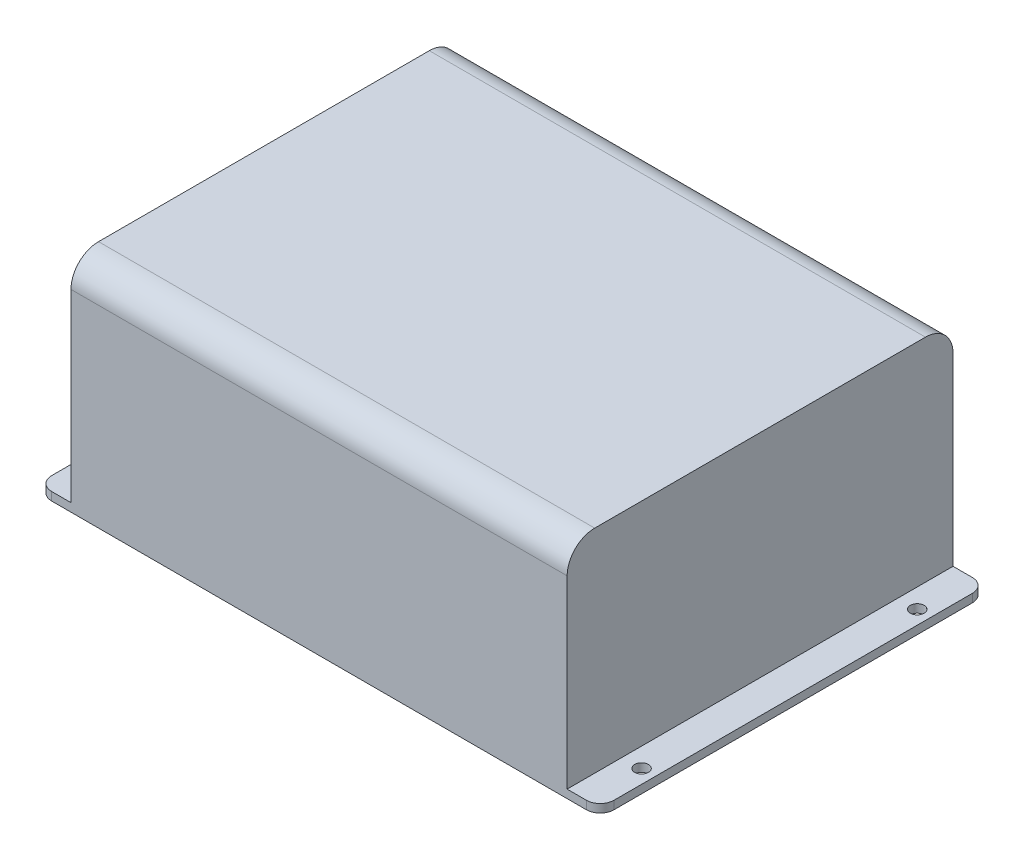
ISO-10303-21;
HEADER;
FILE_DESCRIPTION(('STEP AP214'),'2;1');
FILE_NAME('part.step','',(''),(''),'','','');
FILE_SCHEMA(('AUTOMOTIVE_DESIGN { 1 0 10303 214 1 1 1 1 }'));
ENDSEC;
DATA;
#1=APPLICATION_CONTEXT('core data for automotive mechanical design processes');
#2=APPLICATION_PROTOCOL_DEFINITION('international standard','automotive_design',2000,#1);
#3=PRODUCT_CONTEXT('',#1,'mechanical');
#4=PRODUCT('Part','Part','',(#3));
#5=PRODUCT_RELATED_PRODUCT_CATEGORY('part','',(#4));
#6=PRODUCT_DEFINITION_FORMATION('','',#4);
#7=PRODUCT_DEFINITION_CONTEXT('part definition',#1,'design');
#8=PRODUCT_DEFINITION('design','',#6,#7);
#9=PRODUCT_DEFINITION_SHAPE('','',#8);
#10=(LENGTH_UNIT() NAMED_UNIT(*) SI_UNIT(.MILLI.,.METRE.));
#11=(NAMED_UNIT(*) PLANE_ANGLE_UNIT() SI_UNIT($,.RADIAN.));
#12=(NAMED_UNIT(*) SI_UNIT($,.STERADIAN.) SOLID_ANGLE_UNIT());
#13=UNCERTAINTY_MEASURE_WITH_UNIT(LENGTH_MEASURE(1.E-05),#10,'distance_accuracy_value','');
#14=(GEOMETRIC_REPRESENTATION_CONTEXT(3) GLOBAL_UNCERTAINTY_ASSIGNED_CONTEXT((#13)) GLOBAL_UNIT_ASSIGNED_CONTEXT((#10,
#11,#12)) REPRESENTATION_CONTEXT('',''));
#15=CARTESIAN_POINT('',(0.,0.,0.));
#16=DIRECTION('',(0.,0.,1.));
#17=DIRECTION('',(1.,0.,0.));
#18=AXIS2_PLACEMENT_3D('',#15,#16,#17);
#19=CARTESIAN_POINT('',(-90.,80.,-70.));
#20=DIRECTION('',(1.,0.,0.));
#21=DIRECTION('',(0.,0.,-1.));
#22=AXIS2_PLACEMENT_3D('',#19,#20,#21);
#23=PLANE('',#22);
#24=DIRECTION('',(0.,-1.,0.));
#25=VECTOR('',#24,1.);
#26=CARTESIAN_POINT('',(-90.,80.,70.));
#27=LINE('',#26,#25);
#28=CARTESIAN_POINT('',(-90.,70.,70.));
#29=VERTEX_POINT('',#28);
#30=CARTESIAN_POINT('',(-90.,3.,70.));
#31=VERTEX_POINT('',#30);
#32=EDGE_CURVE('E139',#29,#31,#27,.T.);
#33=ORIENTED_EDGE('',*,*,#32,.F.);
#34=CARTESIAN_POINT('',(-90.,70.,60.));
#35=DIRECTION('',(1.,0.,0.));
#36=DIRECTION('',(0.,0.,-1.));
#37=AXIS2_PLACEMENT_3D('',#34,#35,#36);
#38=CIRCLE('',#37,10.);
#39=CARTESIAN_POINT('',(-90.,80.,60.));
#40=VERTEX_POINT('',#39);
#41=EDGE_CURVE('E41',#29,#40,#38,.F.);
#42=ORIENTED_EDGE('',*,*,#41,.T.);
#43=DIRECTION('',(0.,0.,1.));
#44=VECTOR('',#43,1.);
#45=CARTESIAN_POINT('',(-90.,80.,-70.));
#46=LINE('',#45,#44);
#47=CARTESIAN_POINT('',(-90.,80.,-60.));
#48=VERTEX_POINT('',#47);
#49=EDGE_CURVE('E198',#48,#40,#46,.T.);
#50=ORIENTED_EDGE('',*,*,#49,.F.);
#51=CARTESIAN_POINT('',(-90.,70.,-60.));
#52=DIRECTION('',(1.,0.,0.));
#53=DIRECTION('',(0.,0.,-1.));
#54=AXIS2_PLACEMENT_3D('',#51,#52,#53);
#55=CIRCLE('',#54,10.);
#56=CARTESIAN_POINT('',(-90.,70.,-70.));
#57=VERTEX_POINT('',#56);
#58=EDGE_CURVE('E48',#48,#57,#55,.F.);
#59=ORIENTED_EDGE('',*,*,#58,.T.);
#60=DIRECTION('',(0.,-1.,0.));
#61=VECTOR('',#60,1.);
#62=CARTESIAN_POINT('',(-90.,80.,-70.));
#63=LINE('',#62,#61);
#64=CARTESIAN_POINT('',(-90.,3.,-70.));
#65=VERTEX_POINT('',#64);
#66=EDGE_CURVE('E132',#57,#65,#63,.T.);
#67=ORIENTED_EDGE('',*,*,#66,.T.);
#68=DIRECTION('',(0.,0.,-1.));
#69=VECTOR('',#68,1.);
#70=CARTESIAN_POINT('',(-90.,3.,70.));
#71=LINE('',#70,#69);
#72=EDGE_CURVE('E135',#31,#65,#71,.T.);
#73=ORIENTED_EDGE('',*,*,#72,.F.);
#74=EDGE_LOOP('',(#33,#42,#50,#59,#67,#73));
#75=FACE_BOUND('',#74,.T.);
#76=ADVANCED_FACE('F33',(#75),#23,.F.);
#77=CARTESIAN_POINT('',(90.,80.,-70.));
#78=DIRECTION('',(-1.,0.,0.));
#79=DIRECTION('',(0.,0.,1.));
#80=AXIS2_PLACEMENT_3D('',#77,#78,#79);
#81=PLANE('',#80);
#82=DIRECTION('',(0.,0.,-1.));
#83=VECTOR('',#82,1.);
#84=CARTESIAN_POINT('',(90.,80.,-70.));
#85=LINE('',#84,#83);
#86=CARTESIAN_POINT('',(90.,80.,60.));
#87=VERTEX_POINT('',#86);
#88=CARTESIAN_POINT('',(90.,80.,-60.));
#89=VERTEX_POINT('',#88);
#90=EDGE_CURVE('E195',#87,#89,#85,.T.);
#91=ORIENTED_EDGE('',*,*,#90,.F.);
#92=CARTESIAN_POINT('',(90.,70.,60.));
#93=DIRECTION('',(-1.,0.,0.));
#94=DIRECTION('',(0.,0.,1.));
#95=AXIS2_PLACEMENT_3D('',#92,#93,#94);
#96=CIRCLE('',#95,10.);
#97=CARTESIAN_POINT('',(90.,70.,70.));
#98=VERTEX_POINT('',#97);
#99=EDGE_CURVE('E252',#87,#98,#96,.F.);
#100=ORIENTED_EDGE('',*,*,#99,.T.);
#101=DIRECTION('',(0.,-1.,0.));
#102=VECTOR('',#101,1.);
#103=CARTESIAN_POINT('',(90.,80.,70.));
#104=LINE('',#103,#102);
#105=CARTESIAN_POINT('',(90.,3.,70.));
#106=VERTEX_POINT('',#105);
#107=EDGE_CURVE('E202',#98,#106,#104,.T.);
#108=ORIENTED_EDGE('',*,*,#107,.T.);
#109=DIRECTION('',(0.,0.,-1.));
#110=VECTOR('',#109,1.);
#111=CARTESIAN_POINT('',(90.,3.,70.));
#112=LINE('',#111,#110);
#113=CARTESIAN_POINT('',(90.,3.,-70.));
#114=VERTEX_POINT('',#113);
#115=EDGE_CURVE('E180',#106,#114,#112,.T.);
#116=ORIENTED_EDGE('',*,*,#115,.T.);
#117=DIRECTION('',(0.,-1.,0.));
#118=VECTOR('',#117,1.);
#119=CARTESIAN_POINT('',(90.,80.,-70.));
#120=LINE('',#119,#118);
#121=CARTESIAN_POINT('',(90.,70.,-70.));
#122=VERTEX_POINT('',#121);
#123=EDGE_CURVE('E138',#122,#114,#120,.T.);
#124=ORIENTED_EDGE('',*,*,#123,.F.);
#125=CARTESIAN_POINT('',(90.,70.,-60.));
#126=DIRECTION('',(-1.,0.,0.));
#127=DIRECTION('',(0.,0.,1.));
#128=AXIS2_PLACEMENT_3D('',#125,#126,#127);
#129=CIRCLE('',#128,10.);
#130=EDGE_CURVE('E250',#122,#89,#129,.F.);
#131=ORIENTED_EDGE('',*,*,#130,.T.);
#132=EDGE_LOOP('',(#91,#100,#108,#116,#124,#131));
#133=FACE_BOUND('',#132,.T.);
#134=ADVANCED_FACE('F264',(#133),#81,.F.);
#135=CARTESIAN_POINT('',(-90.,80.,-70.));
#136=DIRECTION('',(0.,0.,1.));
#137=DIRECTION('',(1.,0.,0.));
#138=AXIS2_PLACEMENT_3D('',#135,#136,#137);
#139=PLANE('',#138);
#140=ORIENTED_EDGE('',*,*,#66,.F.);
#141=DIRECTION('',(-1.,0.,0.));
#142=VECTOR('',#141,1.);
#143=CARTESIAN_POINT('',(90.,70.,-70.));
#144=LINE('',#143,#142);
#145=EDGE_CURVE('E11',#57,#122,#144,.F.);
#146=ORIENTED_EDGE('',*,*,#145,.T.);
#147=ORIENTED_EDGE('',*,*,#123,.T.);
#148=DIRECTION('',(1.,0.,0.));
#149=VECTOR('',#148,1.);
#150=CARTESIAN_POINT('',(90.,3.,-70.));
#151=LINE('',#150,#149);
#152=CARTESIAN_POINT('',(97.,3.,-70.));
#153=VERTEX_POINT('',#152);
#154=EDGE_CURVE('E183',#114,#153,#151,.T.);
#155=ORIENTED_EDGE('',*,*,#154,.T.);
#156=DIRECTION('',(0.,-1.,0.));
#157=VECTOR('',#156,1.);
#158=CARTESIAN_POINT('',(97.,0.,-70.));
#159=LINE('',#158,#157);
#160=CARTESIAN_POINT('',(96.9999999999999,0.,-70.));
#161=VERTEX_POINT('',#160);
#162=EDGE_CURVE('E208',#153,#161,#159,.T.);
#163=ORIENTED_EDGE('',*,*,#162,.T.);
#164=DIRECTION('',(-1.,0.,0.));
#165=VECTOR('',#164,1.);
#166=CARTESIAN_POINT('',(-90.,0.,-70.));
#167=LINE('',#166,#165);
#168=CARTESIAN_POINT('',(-97.,0.,-70.));
#169=VERTEX_POINT('',#168);
#170=EDGE_CURVE('E192',#161,#169,#167,.T.);
#171=ORIENTED_EDGE('',*,*,#170,.T.);
#172=DIRECTION('',(0.,-1.,0.));
#173=VECTOR('',#172,1.);
#174=CARTESIAN_POINT('',(-97.,80.,-70.));
#175=LINE('',#174,#173);
#176=CARTESIAN_POINT('',(-97.,3.,-70.));
#177=VERTEX_POINT('',#176);
#178=EDGE_CURVE('E146',#169,#177,#175,.F.);
#179=ORIENTED_EDGE('',*,*,#178,.T.);
#180=DIRECTION('',(-1.,0.,0.));
#181=VECTOR('',#180,1.);
#182=CARTESIAN_POINT('',(-90.,3.,-70.));
#183=LINE('',#182,#181);
#184=EDGE_CURVE('E142',#65,#177,#183,.T.);
#185=ORIENTED_EDGE('',*,*,#184,.F.);
#186=EDGE_LOOP('',(#140,#146,#147,#155,#163,#171,#179,#185));
#187=FACE_BOUND('',#186,.T.);
#188=ADVANCED_FACE('F143',(#187),#139,.F.);
#189=CARTESIAN_POINT('',(-90.,80.,70.));
#190=DIRECTION('',(0.,0.,-1.));
#191=DIRECTION('',(-1.,0.,0.));
#192=AXIS2_PLACEMENT_3D('',#189,#190,#191);
#193=PLANE('',#192);
#194=ORIENTED_EDGE('',*,*,#107,.F.);
#195=DIRECTION('',(1.,0.,0.));
#196=VECTOR('',#195,1.);
#197=CARTESIAN_POINT('',(-90.,70.,70.));
#198=LINE('',#197,#196);
#199=EDGE_CURVE('E56',#98,#29,#198,.F.);
#200=ORIENTED_EDGE('',*,*,#199,.T.);
#201=ORIENTED_EDGE('',*,*,#32,.T.);
#202=DIRECTION('',(1.,0.,0.));
#203=VECTOR('',#202,1.);
#204=CARTESIAN_POINT('',(-90.,3.,70.));
#205=LINE('',#204,#203);
#206=CARTESIAN_POINT('',(-97.,3.,70.));
#207=VERTEX_POINT('',#206);
#208=EDGE_CURVE('E155',#207,#31,#205,.T.);
#209=ORIENTED_EDGE('',*,*,#208,.F.);
#210=DIRECTION('',(0.,-1.,0.));
#211=VECTOR('',#210,1.);
#212=CARTESIAN_POINT('',(-97.,80.,70.));
#213=LINE('',#212,#211);
#214=CARTESIAN_POINT('',(-97.,0.,70.));
#215=VERTEX_POINT('',#214);
#216=EDGE_CURVE('E241',#207,#215,#213,.T.);
#217=ORIENTED_EDGE('',*,*,#216,.T.);
#218=DIRECTION('',(1.,0.,0.));
#219=VECTOR('',#218,1.);
#220=CARTESIAN_POINT('',(-90.,0.,70.));
#221=LINE('',#220,#219);
#222=CARTESIAN_POINT('',(97.,0.,70.));
#223=VERTEX_POINT('',#222);
#224=EDGE_CURVE('E199',#215,#223,#221,.T.);
#225=ORIENTED_EDGE('',*,*,#224,.T.);
#226=DIRECTION('',(0.,-1.,0.));
#227=VECTOR('',#226,1.);
#228=CARTESIAN_POINT('',(97.,3.,70.));
#229=LINE('',#228,#227);
#230=CARTESIAN_POINT('',(97.,3.,70.));
#231=VERTEX_POINT('',#230);
#232=EDGE_CURVE('E225',#223,#231,#229,.F.);
#233=ORIENTED_EDGE('',*,*,#232,.T.);
#234=DIRECTION('',(-1.,0.,0.));
#235=VECTOR('',#234,1.);
#236=CARTESIAN_POINT('',(90.,3.,70.));
#237=LINE('',#236,#235);
#238=EDGE_CURVE('E189',#231,#106,#237,.T.);
#239=ORIENTED_EDGE('',*,*,#238,.T.);
#240=EDGE_LOOP('',(#194,#200,#201,#209,#217,#225,#233,#239));
#241=FACE_BOUND('',#240,.T.);
#242=ADVANCED_FACE('F265',(#241),#193,.F.);
#243=CARTESIAN_POINT('',(0.,80.,0.));
#244=DIRECTION('',(0.,1.,0.));
#245=DIRECTION('',(0.,0.,1.));
#246=AXIS2_PLACEMENT_3D('',#243,#244,#245);
#247=PLANE('',#246);
#248=ORIENTED_EDGE('',*,*,#49,.T.);
#249=DIRECTION('',(1.,0.,0.));
#250=VECTOR('',#249,1.);
#251=CARTESIAN_POINT('',(90.,80.,60.));
#252=LINE('',#251,#250);
#253=EDGE_CURVE('E247',#40,#87,#252,.T.);
#254=ORIENTED_EDGE('',*,*,#253,.T.);
#255=ORIENTED_EDGE('',*,*,#90,.T.);
#256=DIRECTION('',(-1.,0.,0.));
#257=VECTOR('',#256,1.);
#258=CARTESIAN_POINT('',(-90.,80.,-60.));
#259=LINE('',#258,#257);
#260=EDGE_CURVE('E244',#89,#48,#259,.T.);
#261=ORIENTED_EDGE('',*,*,#260,.T.);
#262=EDGE_LOOP('',(#248,#254,#255,#261));
#263=FACE_BOUND('',#262,.T.);
#264=ADVANCED_FACE('F259',(#263),#247,.T.);
#265=CARTESIAN_POINT('',(0.,0.,0.));
#266=DIRECTION('',(0.,1.,0.));
#267=DIRECTION('',(0.,0.,1.));
#268=AXIS2_PLACEMENT_3D('',#265,#266,#267);
#269=PLANE('',#268);
#270=CARTESIAN_POINT('',(-97.,0.,-50.));
#271=DIRECTION('',(0.,-1.,0.));
#272=DIRECTION('',(0.,0.,1.));
#273=AXIS2_PLACEMENT_3D('',#270,#271,#272);
#274=CIRCLE('',#273,2.5);
#275=CARTESIAN_POINT('',(-97.,0.,-47.5));
#276=VERTEX_POINT('',#275);
#277=EDGE_CURVE('E160',#276,#276,#274,.T.);
#278=ORIENTED_EDGE('',*,*,#277,.F.);
#279=EDGE_LOOP('',(#278));
#280=FACE_BOUND('',#279,.T.);
#281=CARTESIAN_POINT('',(-97.,0.,50.));
#282=DIRECTION('',(0.,-1.,0.));
#283=DIRECTION('',(0.,0.,-1.));
#284=AXIS2_PLACEMENT_3D('',#281,#282,#283);
#285=CIRCLE('',#284,2.5);
#286=CARTESIAN_POINT('',(-97.,0.,47.5));
#287=VERTEX_POINT('',#286);
#288=EDGE_CURVE('E365',#287,#287,#285,.T.);
#289=ORIENTED_EDGE('',*,*,#288,.F.);
#290=EDGE_LOOP('',(#289));
#291=FACE_BOUND('',#290,.T.);
#292=CARTESIAN_POINT('',(97.,0.,-50.));
#293=DIRECTION('',(0.,1.,0.));
#294=DIRECTION('',(0.,0.,1.));
#295=AXIS2_PLACEMENT_3D('',#292,#293,#294);
#296=CIRCLE('',#295,2.5);
#297=CARTESIAN_POINT('',(97.,0.,-47.5));
#298=VERTEX_POINT('',#297);
#299=EDGE_CURVE('E168',#298,#298,#296,.T.);
#300=ORIENTED_EDGE('',*,*,#299,.T.);
#301=EDGE_LOOP('',(#300));
#302=FACE_BOUND('',#301,.T.);
#303=CARTESIAN_POINT('',(97.,0.,50.));
#304=DIRECTION('',(0.,1.,0.));
#305=DIRECTION('',(0.,0.,-1.));
#306=AXIS2_PLACEMENT_3D('',#303,#304,#305);
#307=CIRCLE('',#306,2.5);
#308=CARTESIAN_POINT('',(97.,0.,47.5));
#309=VERTEX_POINT('',#308);
#310=EDGE_CURVE('E175',#309,#309,#307,.T.);
#311=ORIENTED_EDGE('',*,*,#310,.T.);
#312=EDGE_LOOP('',(#311));
#313=FACE_BOUND('',#312,.T.);
#314=DIRECTION('',(0.,0.,1.));
#315=VECTOR('',#314,1.);
#316=CARTESIAN_POINT('',(-102.,0.,70.));
#317=LINE('',#316,#315);
#318=CARTESIAN_POINT('',(-102.,0.,-65.));
#319=VERTEX_POINT('',#318);
#320=CARTESIAN_POINT('',(-102.,0.,65.));
#321=VERTEX_POINT('',#320);
#322=EDGE_CURVE('E156',#319,#321,#317,.T.);
#323=ORIENTED_EDGE('',*,*,#322,.F.);
#324=CARTESIAN_POINT('',(-97.,0.,-65.));
#325=DIRECTION('',(0.,1.,0.));
#326=DIRECTION('',(0.,0.,1.));
#327=AXIS2_PLACEMENT_3D('',#324,#325,#326);
#328=CIRCLE('',#327,5.);
#329=EDGE_CURVE('E234',#319,#169,#328,.F.);
#330=ORIENTED_EDGE('',*,*,#329,.T.);
#331=ORIENTED_EDGE('',*,*,#170,.F.);
#332=CARTESIAN_POINT('',(97.,0.,-65.));
#333=DIRECTION('',(0.,1.,0.));
#334=DIRECTION('',(0.,0.,1.));
#335=AXIS2_PLACEMENT_3D('',#332,#333,#334);
#336=CIRCLE('',#335,5.);
#337=CARTESIAN_POINT('',(102.,0.,-65.));
#338=VERTEX_POINT('',#337);
#339=EDGE_CURVE('E214',#161,#338,#336,.F.);
#340=ORIENTED_EDGE('',*,*,#339,.T.);
#341=DIRECTION('',(0.,0.,1.));
#342=VECTOR('',#341,1.);
#343=CARTESIAN_POINT('',(102.,0.,70.));
#344=LINE('',#343,#342);
#345=CARTESIAN_POINT('',(102.,0.,65.));
#346=VERTEX_POINT('',#345);
#347=EDGE_CURVE('E171',#338,#346,#344,.T.);
#348=ORIENTED_EDGE('',*,*,#347,.T.);
#349=CARTESIAN_POINT('',(97.,0.,65.));
#350=DIRECTION('',(0.,1.,0.));
#351=DIRECTION('',(0.,0.,1.));
#352=AXIS2_PLACEMENT_3D('',#349,#350,#351);
#353=CIRCLE('',#352,5.);
#354=EDGE_CURVE('E211',#346,#223,#353,.F.);
#355=ORIENTED_EDGE('',*,*,#354,.T.);
#356=ORIENTED_EDGE('',*,*,#224,.F.);
#357=CARTESIAN_POINT('',(-97.,0.,65.));
#358=DIRECTION('',(0.,1.,0.));
#359=DIRECTION('',(0.,0.,1.));
#360=AXIS2_PLACEMENT_3D('',#357,#358,#359);
#361=CIRCLE('',#360,5.);
#362=EDGE_CURVE('E232',#215,#321,#361,.F.);
#363=ORIENTED_EDGE('',*,*,#362,.T.);
#364=EDGE_LOOP('',(#323,#330,#331,#340,#348,#355,#356,#363));
#365=FACE_BOUND('',#364,.T.);
#366=ADVANCED_FACE('F322',(#280,#291,#302,#313,#365),#269,.F.);
#367=CARTESIAN_POINT('',(102.,3.,70.));
#368=DIRECTION('',(1.,0.,0.));
#369=DIRECTION('',(0.,0.,-1.));
#370=AXIS2_PLACEMENT_3D('',#367,#368,#369);
#371=PLANE('',#370);
#372=ORIENTED_EDGE('',*,*,#347,.F.);
#373=DIRECTION('',(0.,-1.,0.));
#374=VECTOR('',#373,1.);
#375=CARTESIAN_POINT('',(102.,3.,-65.));
#376=LINE('',#375,#374);
#377=CARTESIAN_POINT('',(102.,3.,-65.));
#378=VERTEX_POINT('',#377);
#379=EDGE_CURVE('E219',#338,#378,#376,.F.);
#380=ORIENTED_EDGE('',*,*,#379,.T.);
#381=DIRECTION('',(0.,0.,1.));
#382=VECTOR('',#381,1.);
#383=CARTESIAN_POINT('',(102.,3.,70.));
#384=LINE('',#383,#382);
#385=CARTESIAN_POINT('',(102.,3.,65.));
#386=VERTEX_POINT('',#385);
#387=EDGE_CURVE('E186',#378,#386,#384,.T.);
#388=ORIENTED_EDGE('',*,*,#387,.T.);
#389=DIRECTION('',(0.,-1.,0.));
#390=VECTOR('',#389,1.);
#391=CARTESIAN_POINT('',(102.,0.,65.));
#392=LINE('',#391,#390);
#393=EDGE_CURVE('E216',#386,#346,#392,.T.);
#394=ORIENTED_EDGE('',*,*,#393,.T.);
#395=EDGE_LOOP('',(#372,#380,#388,#394));
#396=FACE_BOUND('',#395,.T.);
#397=ADVANCED_FACE('F327',(#396),#371,.T.);
#398=CARTESIAN_POINT('',(0.,3.,0.));
#399=DIRECTION('',(0.,-1.,0.));
#400=DIRECTION('',(0.,0.,-1.));
#401=AXIS2_PLACEMENT_3D('',#398,#399,#400);
#402=PLANE('',#401);
#403=CARTESIAN_POINT('',(97.,3.,-50.));
#404=DIRECTION('',(0.,1.,0.));
#405=DIRECTION('',(0.,0.,1.));
#406=AXIS2_PLACEMENT_3D('',#403,#404,#405);
#407=CIRCLE('',#406,2.5);
#408=CARTESIAN_POINT('',(97.,3.,-47.5));
#409=VERTEX_POINT('',#408);
#410=EDGE_CURVE('E172',#409,#409,#407,.T.);
#411=ORIENTED_EDGE('',*,*,#410,.F.);
#412=EDGE_LOOP('',(#411));
#413=FACE_BOUND('',#412,.T.);
#414=CARTESIAN_POINT('',(97.,3.,50.));
#415=DIRECTION('',(0.,1.,0.));
#416=DIRECTION('',(0.,0.,-1.));
#417=AXIS2_PLACEMENT_3D('',#414,#415,#416);
#418=CIRCLE('',#417,2.5);
#419=CARTESIAN_POINT('',(97.,3.,47.5));
#420=VERTEX_POINT('',#419);
#421=EDGE_CURVE('E149',#420,#420,#418,.T.);
#422=ORIENTED_EDGE('',*,*,#421,.F.);
#423=EDGE_LOOP('',(#422));
#424=FACE_BOUND('',#423,.T.);
#425=ORIENTED_EDGE('',*,*,#387,.F.);
#426=CARTESIAN_POINT('',(97.,3.,-65.));
#427=DIRECTION('',(0.,-1.,0.));
#428=DIRECTION('',(0.,0.,-1.));
#429=AXIS2_PLACEMENT_3D('',#426,#427,#428);
#430=CIRCLE('',#429,5.);
#431=EDGE_CURVE('E223',#378,#153,#430,.F.);
#432=ORIENTED_EDGE('',*,*,#431,.T.);
#433=ORIENTED_EDGE('',*,*,#154,.F.);
#434=ORIENTED_EDGE('',*,*,#115,.F.);
#435=ORIENTED_EDGE('',*,*,#238,.F.);
#436=CARTESIAN_POINT('',(97.,3.,65.));
#437=DIRECTION('',(0.,-1.,0.));
#438=DIRECTION('',(0.,0.,-1.));
#439=AXIS2_PLACEMENT_3D('',#436,#437,#438);
#440=CIRCLE('',#439,5.);
#441=EDGE_CURVE('E221',#231,#386,#440,.F.);
#442=ORIENTED_EDGE('',*,*,#441,.T.);
#443=EDGE_LOOP('',(#425,#432,#433,#434,#435,#442));
#444=FACE_BOUND('',#443,.T.);
#445=ADVANCED_FACE('F273',(#413,#424,#444),#402,.F.);
#446=CARTESIAN_POINT('',(97.,80.,-65.));
#447=DIRECTION('',(0.,1.,0.));
#448=DIRECTION('',(0.,0.,1.));
#449=AXIS2_PLACEMENT_3D('',#446,#447,#448);
#450=CYLINDRICAL_SURFACE('',#449,5.);
#451=ORIENTED_EDGE('',*,*,#431,.F.);
#452=ORIENTED_EDGE('',*,*,#379,.F.);
#453=ORIENTED_EDGE('',*,*,#339,.F.);
#454=ORIENTED_EDGE('',*,*,#162,.F.);
#455=EDGE_LOOP('',(#451,#452,#453,#454));
#456=FACE_BOUND('',#455,.T.);
#457=ADVANCED_FACE('F293',(#456),#450,.T.);
#458=CARTESIAN_POINT('',(97.,3.,65.));
#459=DIRECTION('',(0.,1.,0.));
#460=DIRECTION('',(0.,0.,1.));
#461=AXIS2_PLACEMENT_3D('',#458,#459,#460);
#462=CYLINDRICAL_SURFACE('',#461,5.);
#463=ORIENTED_EDGE('',*,*,#441,.F.);
#464=ORIENTED_EDGE('',*,*,#232,.F.);
#465=ORIENTED_EDGE('',*,*,#354,.F.);
#466=ORIENTED_EDGE('',*,*,#393,.F.);
#467=EDGE_LOOP('',(#463,#464,#465,#466));
#468=FACE_BOUND('',#467,.T.);
#469=ADVANCED_FACE('F296',(#468),#462,.T.);
#470=CARTESIAN_POINT('',(97.,0.,50.));
#471=DIRECTION('',(0.,1.,0.));
#472=DIRECTION('',(0.,0.,1.));
#473=AXIS2_PLACEMENT_3D('',#470,#471,#472);
#474=CYLINDRICAL_SURFACE('',#473,2.5);
#475=ORIENTED_EDGE('',*,*,#310,.F.);
#476=EDGE_LOOP('',(#475));
#477=FACE_BOUND('',#476,.T.);
#478=ORIENTED_EDGE('',*,*,#421,.T.);
#479=EDGE_LOOP('',(#478));
#480=FACE_BOUND('',#479,.T.);
#481=ADVANCED_FACE('F300',(#477,#480),#474,.F.);
#482=CARTESIAN_POINT('',(97.,0.,-50.));
#483=DIRECTION('',(0.,1.,0.));
#484=DIRECTION('',(0.,0.,1.));
#485=AXIS2_PLACEMENT_3D('',#482,#483,#484);
#486=CYLINDRICAL_SURFACE('',#485,2.5);
#487=ORIENTED_EDGE('',*,*,#299,.F.);
#488=EDGE_LOOP('',(#487));
#489=FACE_BOUND('',#488,.T.);
#490=ORIENTED_EDGE('',*,*,#410,.T.);
#491=EDGE_LOOP('',(#490));
#492=FACE_BOUND('',#491,.T.);
#493=ADVANCED_FACE('F335',(#489,#492),#486,.F.);
#494=CARTESIAN_POINT('',(-102.,3.,70.));
#495=DIRECTION('',(1.,0.,0.));
#496=DIRECTION('',(0.,0.,-1.));
#497=AXIS2_PLACEMENT_3D('',#494,#495,#496);
#498=PLANE('',#497);
#499=DIRECTION('',(0.,0.,1.));
#500=VECTOR('',#499,1.);
#501=CARTESIAN_POINT('',(-102.,3.,70.));
#502=LINE('',#501,#500);
#503=CARTESIAN_POINT('',(-102.,3.,-65.));
#504=VERTEX_POINT('',#503);
#505=CARTESIAN_POINT('',(-102.,3.,65.));
#506=VERTEX_POINT('',#505);
#507=EDGE_CURVE('E150',#504,#506,#502,.T.);
#508=ORIENTED_EDGE('',*,*,#507,.F.);
#509=DIRECTION('',(0.,-1.,0.));
#510=VECTOR('',#509,1.);
#511=CARTESIAN_POINT('',(-102.,3.,-65.));
#512=LINE('',#511,#510);
#513=EDGE_CURVE('E229',#504,#319,#512,.T.);
#514=ORIENTED_EDGE('',*,*,#513,.T.);
#515=ORIENTED_EDGE('',*,*,#322,.T.);
#516=DIRECTION('',(0.,-1.,0.));
#517=VECTOR('',#516,1.);
#518=CARTESIAN_POINT('',(-102.,3.,65.));
#519=LINE('',#518,#517);
#520=EDGE_CURVE('E227',#321,#506,#519,.F.);
#521=ORIENTED_EDGE('',*,*,#520,.T.);
#522=EDGE_LOOP('',(#508,#514,#515,#521));
#523=FACE_BOUND('',#522,.T.);
#524=ADVANCED_FACE('F333',(#523),#498,.F.);
#525=CARTESIAN_POINT('',(0.,3.,0.));
#526=DIRECTION('',(0.,-1.,0.));
#527=DIRECTION('',(0.,0.,-1.));
#528=AXIS2_PLACEMENT_3D('',#525,#526,#527);
#529=PLANE('',#528);
#530=CARTESIAN_POINT('',(-97.,3.,-50.));
#531=DIRECTION('',(0.,-1.,0.));
#532=DIRECTION('',(0.,0.,1.));
#533=AXIS2_PLACEMENT_3D('',#530,#531,#532);
#534=CIRCLE('',#533,2.5);
#535=CARTESIAN_POINT('',(-97.,3.,-47.5));
#536=VERTEX_POINT('',#535);
#537=EDGE_CURVE('E374',#536,#536,#534,.T.);
#538=ORIENTED_EDGE('',*,*,#537,.T.);
#539=EDGE_LOOP('',(#538));
#540=FACE_BOUND('',#539,.T.);
#541=CARTESIAN_POINT('',(-97.,3.,50.));
#542=DIRECTION('',(0.,-1.,0.));
#543=DIRECTION('',(0.,0.,-1.));
#544=AXIS2_PLACEMENT_3D('',#541,#542,#543);
#545=CIRCLE('',#544,2.5);
#546=CARTESIAN_POINT('',(-97.,3.,47.5));
#547=VERTEX_POINT('',#546);
#548=EDGE_CURVE('E163',#547,#547,#545,.T.);
#549=ORIENTED_EDGE('',*,*,#548,.T.);
#550=EDGE_LOOP('',(#549));
#551=FACE_BOUND('',#550,.T.);
#552=ORIENTED_EDGE('',*,*,#184,.T.);
#553=CARTESIAN_POINT('',(-97.,3.,-65.));
#554=DIRECTION('',(0.,-1.,0.));
#555=DIRECTION('',(0.,0.,-1.));
#556=AXIS2_PLACEMENT_3D('',#553,#554,#555);
#557=CIRCLE('',#556,5.);
#558=EDGE_CURVE('E239',#177,#504,#557,.F.);
#559=ORIENTED_EDGE('',*,*,#558,.T.);
#560=ORIENTED_EDGE('',*,*,#507,.T.);
#561=CARTESIAN_POINT('',(-97.,3.,65.));
#562=DIRECTION('',(0.,-1.,0.));
#563=DIRECTION('',(0.,0.,-1.));
#564=AXIS2_PLACEMENT_3D('',#561,#562,#563);
#565=CIRCLE('',#564,5.);
#566=EDGE_CURVE('E237',#506,#207,#565,.F.);
#567=ORIENTED_EDGE('',*,*,#566,.T.);
#568=ORIENTED_EDGE('',*,*,#208,.T.);
#569=ORIENTED_EDGE('',*,*,#72,.T.);
#570=EDGE_LOOP('',(#552,#559,#560,#567,#568,#569));
#571=FACE_BOUND('',#570,.T.);
#572=ADVANCED_FACE('F153',(#540,#551,#571),#529,.F.);
#573=CARTESIAN_POINT('',(-97.,3.,-65.));
#574=DIRECTION('',(0.,-1.,0.));
#575=DIRECTION('',(0.,0.,-1.));
#576=AXIS2_PLACEMENT_3D('',#573,#574,#575);
#577=CYLINDRICAL_SURFACE('',#576,5.);
#578=ORIENTED_EDGE('',*,*,#558,.F.);
#579=ORIENTED_EDGE('',*,*,#178,.F.);
#580=ORIENTED_EDGE('',*,*,#329,.F.);
#581=ORIENTED_EDGE('',*,*,#513,.F.);
#582=EDGE_LOOP('',(#578,#579,#580,#581));
#583=FACE_BOUND('',#582,.T.);
#584=ADVANCED_FACE('F302',(#583),#577,.T.);
#585=CARTESIAN_POINT('',(-97.,80.,65.));
#586=DIRECTION('',(0.,-1.,0.));
#587=DIRECTION('',(0.,0.,-1.));
#588=AXIS2_PLACEMENT_3D('',#585,#586,#587);
#589=CYLINDRICAL_SURFACE('',#588,5.);
#590=ORIENTED_EDGE('',*,*,#566,.F.);
#591=ORIENTED_EDGE('',*,*,#520,.F.);
#592=ORIENTED_EDGE('',*,*,#362,.F.);
#593=ORIENTED_EDGE('',*,*,#216,.F.);
#594=EDGE_LOOP('',(#590,#591,#592,#593));
#595=FACE_BOUND('',#594,.T.);
#596=ADVANCED_FACE('F305',(#595),#589,.T.);
#597=CARTESIAN_POINT('',(-97.,0.,50.));
#598=DIRECTION('',(0.,1.,0.));
#599=DIRECTION('',(0.,0.,1.));
#600=AXIS2_PLACEMENT_3D('',#597,#598,#599);
#601=CYLINDRICAL_SURFACE('',#600,2.5);
#602=ORIENTED_EDGE('',*,*,#288,.T.);
#603=EDGE_LOOP('',(#602));
#604=FACE_BOUND('',#603,.T.);
#605=ORIENTED_EDGE('',*,*,#548,.F.);
#606=EDGE_LOOP('',(#605));
#607=FACE_BOUND('',#606,.T.);
#608=ADVANCED_FACE('F308',(#604,#607),#601,.F.);
#609=CARTESIAN_POINT('',(-97.,0.,-50.));
#610=DIRECTION('',(0.,1.,0.));
#611=DIRECTION('',(0.,0.,1.));
#612=AXIS2_PLACEMENT_3D('',#609,#610,#611);
#613=CYLINDRICAL_SURFACE('',#612,2.5);
#614=ORIENTED_EDGE('',*,*,#277,.T.);
#615=EDGE_LOOP('',(#614));
#616=FACE_BOUND('',#615,.T.);
#617=ORIENTED_EDGE('',*,*,#537,.F.);
#618=EDGE_LOOP('',(#617));
#619=FACE_BOUND('',#618,.T.);
#620=ADVANCED_FACE('F281',(#616,#619),#613,.F.);
#621=CARTESIAN_POINT('',(0.,70.,60.));
#622=DIRECTION('',(-1.,0.,0.));
#623=DIRECTION('',(0.,0.,1.));
#624=AXIS2_PLACEMENT_3D('',#621,#622,#623);
#625=CYLINDRICAL_SURFACE('',#624,10.);
#626=ORIENTED_EDGE('',*,*,#41,.F.);
#627=ORIENTED_EDGE('',*,*,#199,.F.);
#628=ORIENTED_EDGE('',*,*,#99,.F.);
#629=ORIENTED_EDGE('',*,*,#253,.F.);
#630=EDGE_LOOP('',(#626,#627,#628,#629));
#631=FACE_BOUND('',#630,.T.);
#632=ADVANCED_FACE('F262',(#631),#625,.T.);
#633=CARTESIAN_POINT('',(0.,70.,-60.));
#634=DIRECTION('',(1.,0.,0.));
#635=DIRECTION('',(0.,0.,-1.));
#636=AXIS2_PLACEMENT_3D('',#633,#634,#635);
#637=CYLINDRICAL_SURFACE('',#636,10.);
#638=ORIENTED_EDGE('',*,*,#130,.F.);
#639=ORIENTED_EDGE('',*,*,#145,.F.);
#640=ORIENTED_EDGE('',*,*,#58,.F.);
#641=ORIENTED_EDGE('',*,*,#260,.F.);
#642=EDGE_LOOP('',(#638,#639,#640,#641));
#643=FACE_BOUND('',#642,.T.);
#644=ADVANCED_FACE('F35',(#643),#637,.T.);
#645=CLOSED_SHELL('',(#76,#134,#188,#242,#264,#366,#397,#445,#457,#469,#481,#493,#524,#572,#584,
#596,#608,#620,#632,#644));
#646=MANIFOLD_SOLID_BREP('B2',#645);
#647=ADVANCED_BREP_SHAPE_REPRESENTATION('',(#18,#646),#14);
#648=SHAPE_DEFINITION_REPRESENTATION(#9,#647);
ENDSEC;
END-ISO-10303-21;
